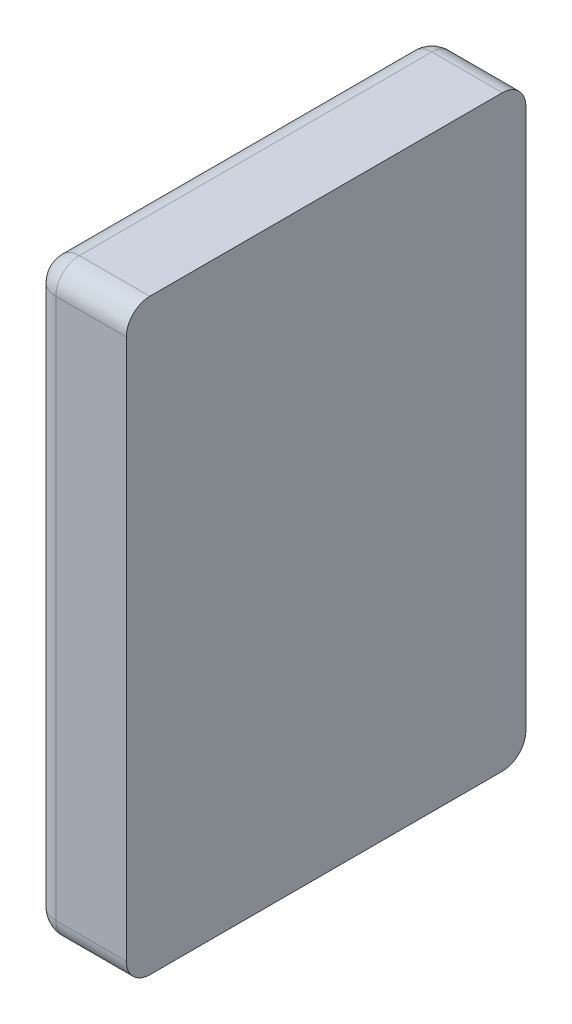
ISO-10303-21;
HEADER;
FILE_DESCRIPTION(('STEP AP214'),'2;1');
FILE_NAME('part.step','',(''),(''),'','','');
FILE_SCHEMA(('AUTOMOTIVE_DESIGN { 1 0 10303 214 1 1 1 1 }'));
ENDSEC;
DATA;
#1=APPLICATION_CONTEXT('core data for automotive mechanical design processes');
#2=APPLICATION_PROTOCOL_DEFINITION('international standard','automotive_design',2000,#1);
#3=PRODUCT_CONTEXT('',#1,'mechanical');
#4=PRODUCT('Part','Part','',(#3));
#5=PRODUCT_RELATED_PRODUCT_CATEGORY('part','',(#4));
#6=PRODUCT_DEFINITION_FORMATION('','',#4);
#7=PRODUCT_DEFINITION_CONTEXT('part definition',#1,'design');
#8=PRODUCT_DEFINITION('design','',#6,#7);
#9=PRODUCT_DEFINITION_SHAPE('','',#8);
#10=(LENGTH_UNIT() NAMED_UNIT(*) SI_UNIT(.MILLI.,.METRE.));
#11=(NAMED_UNIT(*) PLANE_ANGLE_UNIT() SI_UNIT($,.RADIAN.));
#12=(NAMED_UNIT(*) SI_UNIT($,.STERADIAN.) SOLID_ANGLE_UNIT());
#13=UNCERTAINTY_MEASURE_WITH_UNIT(LENGTH_MEASURE(1.E-05),#10,'distance_accuracy_value','');
#14=(GEOMETRIC_REPRESENTATION_CONTEXT(3) GLOBAL_UNCERTAINTY_ASSIGNED_CONTEXT((#13)) GLOBAL_UNIT_ASSIGNED_CONTEXT((#10,
#11,#12)) REPRESENTATION_CONTEXT('',''));
#15=CARTESIAN_POINT('',(0.,0.,0.));
#16=DIRECTION('',(0.,0.,1.));
#17=DIRECTION('',(1.,0.,0.));
#18=AXIS2_PLACEMENT_3D('',#15,#16,#17);
#19=CARTESIAN_POINT('',(-0.9,-0.625,0.));
#20=DIRECTION('',(0.,0.,1.));
#21=DIRECTION('',(1.,0.,0.));
#22=AXIS2_PLACEMENT_3D('',#19,#20,#21);
#23=PLANE('',#22);
#24=DIRECTION('',(0.,1.,0.));
#25=VECTOR('',#24,1.);
#26=CARTESIAN_POINT('',(-0.95,-0.625,0.));
#27=LINE('',#26,#25);
#28=CARTESIAN_POINT('',(-0.95,-0.575,0.));
#29=VERTEX_POINT('',#28);
#30=CARTESIAN_POINT('',(-0.95,0.575,0.));
#31=VERTEX_POINT('',#30);
#32=EDGE_CURVE('E233',#29,#31,#27,.T.);
#33=ORIENTED_EDGE('',*,*,#32,.T.);
#34=DIRECTION('',(1.,0.,0.));
#35=VECTOR('',#34,1.);
#36=CARTESIAN_POINT('',(-0.9,0.575,0.));
#37=LINE('',#36,#35);
#38=CARTESIAN_POINT('',(-0.8,0.575,0.));
#39=VERTEX_POINT('',#38);
#40=EDGE_CURVE('E69',#31,#39,#37,.T.);
#41=ORIENTED_EDGE('',*,*,#40,.T.);
#42=DIRECTION('',(0.,1.,0.));
#43=VECTOR('',#42,1.);
#44=CARTESIAN_POINT('',(-0.8,-0.625,0.));
#45=LINE('',#44,#43);
#46=CARTESIAN_POINT('',(-0.8,-0.575,0.));
#47=VERTEX_POINT('',#46);
#48=EDGE_CURVE('E172',#47,#39,#45,.T.);
#49=ORIENTED_EDGE('',*,*,#48,.F.);
#50=DIRECTION('',(-1.,0.,0.));
#51=VECTOR('',#50,1.);
#52=CARTESIAN_POINT('',(-1.,-0.575,0.));
#53=LINE('',#52,#51);
#54=EDGE_CURVE('E83',#47,#29,#53,.T.);
#55=ORIENTED_EDGE('',*,*,#54,.T.);
#56=EDGE_LOOP('',(#33,#41,#49,#55));
#57=FACE_BOUND('',#56,.T.);
#58=ADVANCED_FACE('F17',(#57),#23,.F.);
#59=CARTESIAN_POINT('',(-0.5,-0.625,0.425));
#60=DIRECTION('',(0.,-1.,0.));
#61=DIRECTION('',(0.,0.,-1.));
#62=AXIS2_PLACEMENT_3D('',#59,#60,#61);
#63=PLANE('',#62);
#64=DIRECTION('',(0.,0.,1.));
#65=VECTOR('',#64,1.);
#66=CARTESIAN_POINT('',(-0.8,-0.625,0.649600008));
#67=LINE('',#66,#65);
#68=CARTESIAN_POINT('',(-0.8,-0.625,0.05));
#69=VERTEX_POINT('',#68);
#70=CARTESIAN_POINT('',(-0.8,-0.625,0.8));
#71=VERTEX_POINT('',#70);
#72=EDGE_CURVE('E190',#69,#71,#67,.T.);
#73=ORIENTED_EDGE('',*,*,#72,.T.);
#74=DIRECTION('',(-1.,0.,0.));
#75=VECTOR('',#74,1.);
#76=CARTESIAN_POINT('',(-1.,-0.625,0.8));
#77=LINE('',#76,#75);
#78=CARTESIAN_POINT('',(-0.95,-0.625,0.8));
#79=VERTEX_POINT('',#78);
#80=EDGE_CURVE('E11',#71,#79,#77,.T.);
#81=ORIENTED_EDGE('',*,*,#80,.T.);
#82=DIRECTION('',(0.,0.,-1.));
#83=VECTOR('',#82,1.);
#84=CARTESIAN_POINT('',(-0.95,-0.625,0.));
#85=LINE('',#84,#83);
#86=CARTESIAN_POINT('',(-0.95,-0.625,0.05));
#87=VERTEX_POINT('',#86);
#88=EDGE_CURVE('E28',#79,#87,#85,.T.);
#89=ORIENTED_EDGE('',*,*,#88,.T.);
#90=DIRECTION('',(1.,0.,0.));
#91=VECTOR('',#90,1.);
#92=CARTESIAN_POINT('',(-0.8,-0.625,0.05));
#93=LINE('',#92,#91);
#94=EDGE_CURVE('E167',#87,#69,#93,.T.);
#95=ORIENTED_EDGE('',*,*,#94,.T.);
#96=EDGE_LOOP('',(#73,#81,#89,#95));
#97=FACE_BOUND('',#96,.T.);
#98=ADVANCED_FACE('F19',(#97),#63,.T.);
#99=CARTESIAN_POINT('',(-0.5,0.625,0.425));
#100=DIRECTION('',(0.,-1.,0.));
#101=DIRECTION('',(0.,0.,-1.));
#102=AXIS2_PLACEMENT_3D('',#99,#100,#101);
#103=PLANE('',#102);
#104=DIRECTION('',(0.,0.,1.));
#105=VECTOR('',#104,1.);
#106=CARTESIAN_POINT('',(-0.95,0.625,0.425));
#107=LINE('',#106,#105);
#108=CARTESIAN_POINT('',(-0.95,0.625,0.05));
#109=VERTEX_POINT('',#108);
#110=CARTESIAN_POINT('',(-0.95,0.625,0.8));
#111=VERTEX_POINT('',#110);
#112=EDGE_CURVE('E132',#109,#111,#107,.T.);
#113=ORIENTED_EDGE('',*,*,#112,.T.);
#114=DIRECTION('',(1.,0.,0.));
#115=VECTOR('',#114,1.);
#116=CARTESIAN_POINT('',(-0.5,0.625,0.8));
#117=LINE('',#116,#115);
#118=CARTESIAN_POINT('',(-0.8,0.625,0.8));
#119=VERTEX_POINT('',#118);
#120=EDGE_CURVE('E222',#111,#119,#117,.T.);
#121=ORIENTED_EDGE('',*,*,#120,.T.);
#122=DIRECTION('',(0.,0.,1.));
#123=VECTOR('',#122,1.);
#124=CARTESIAN_POINT('',(-0.8,0.625,0.649600008));
#125=LINE('',#124,#123);
#126=CARTESIAN_POINT('',(-0.8,0.625,0.05));
#127=VERTEX_POINT('',#126);
#128=EDGE_CURVE('E136',#127,#119,#125,.T.);
#129=ORIENTED_EDGE('',*,*,#128,.F.);
#130=DIRECTION('',(-1.,0.,0.));
#131=VECTOR('',#130,1.);
#132=CARTESIAN_POINT('',(-0.5,0.625,0.05));
#133=LINE('',#132,#131);
#134=EDGE_CURVE('E127',#127,#109,#133,.T.);
#135=ORIENTED_EDGE('',*,*,#134,.T.);
#136=EDGE_LOOP('',(#113,#121,#129,#135));
#137=FACE_BOUND('',#136,.T.);
#138=ADVANCED_FACE('F129',(#137),#103,.F.);
#139=CARTESIAN_POINT('',(-0.5,-0.575,0.8));
#140=DIRECTION('',(-1.,0.,0.));
#141=DIRECTION('',(0.,0.,-1.));
#142=AXIS2_PLACEMENT_3D('',#139,#140,#141);
#143=CYLINDRICAL_SURFACE('',#142,0.05);
#144=CARTESIAN_POINT('',(-0.8,-0.575,0.8));
#145=DIRECTION('',(1.,0.,0.));
#146=DIRECTION('',(0.,0.,1.));
#147=AXIS2_PLACEMENT_3D('',#144,#145,#146);
#148=CIRCLE('',#147,0.05);
#149=CARTESIAN_POINT('',(-0.8,-0.575,0.85));
#150=VERTEX_POINT('',#149);
#151=EDGE_CURVE('E196',#150,#71,#148,.T.);
#152=ORIENTED_EDGE('',*,*,#151,.F.);
#153=DIRECTION('',(1.,0.,0.));
#154=VECTOR('',#153,1.);
#155=CARTESIAN_POINT('',(-0.8,-0.575,0.85));
#156=LINE('',#155,#154);
#157=CARTESIAN_POINT('',(-0.95,-0.575,0.85));
#158=VERTEX_POINT('',#157);
#159=EDGE_CURVE('E236',#158,#150,#156,.T.);
#160=ORIENTED_EDGE('',*,*,#159,.F.);
#161=CARTESIAN_POINT('',(-0.95,-0.575,0.8));
#162=DIRECTION('',(-1.,0.,0.));
#163=DIRECTION('',(0.,0.,1.));
#164=AXIS2_PLACEMENT_3D('',#161,#162,#163);
#165=CIRCLE('',#164,0.05);
#166=EDGE_CURVE('E257',#79,#158,#165,.T.);
#167=ORIENTED_EDGE('',*,*,#166,.F.);
#168=ORIENTED_EDGE('',*,*,#80,.F.);
#169=EDGE_LOOP('',(#152,#160,#167,#168));
#170=FACE_BOUND('',#169,.T.);
#171=ADVANCED_FACE('F312',(#170),#143,.T.);
#172=CARTESIAN_POINT('',(-0.95,-0.575,0.425));
#173=DIRECTION('',(0.,0.,-1.));
#174=DIRECTION('',(1.,0.,0.));
#175=AXIS2_PLACEMENT_3D('',#172,#173,#174);
#176=CYLINDRICAL_SURFACE('',#175,0.05);
#177=CARTESIAN_POINT('',(-0.95,-0.575,0.05));
#178=DIRECTION('',(0.,0.,-1.));
#179=DIRECTION('',(-1.,0.,0.));
#180=AXIS2_PLACEMENT_3D('',#177,#178,#179);
#181=CIRCLE('',#180,0.05);
#182=CARTESIAN_POINT('',(-1.,-0.575,0.05));
#183=VERTEX_POINT('',#182);
#184=EDGE_CURVE('E227',#87,#183,#181,.T.);
#185=ORIENTED_EDGE('',*,*,#184,.F.);
#186=ORIENTED_EDGE('',*,*,#88,.F.);
#187=CARTESIAN_POINT('',(-0.95,-0.575,0.8));
#188=DIRECTION('',(0.,0.,1.));
#189=DIRECTION('',(1.,0.,0.));
#190=AXIS2_PLACEMENT_3D('',#187,#188,#189);
#191=CIRCLE('',#190,0.05);
#192=CARTESIAN_POINT('',(-1.,-0.575,0.8));
#193=VERTEX_POINT('',#192);
#194=EDGE_CURVE('E114',#193,#79,#191,.T.);
#195=ORIENTED_EDGE('',*,*,#194,.F.);
#196=DIRECTION('',(0.,0.,1.));
#197=VECTOR('',#196,1.);
#198=CARTESIAN_POINT('',(-1.,-0.575,0.85));
#199=LINE('',#198,#197);
#200=EDGE_CURVE('E195',#183,#193,#199,.T.);
#201=ORIENTED_EDGE('',*,*,#200,.F.);
#202=EDGE_LOOP('',(#185,#186,#195,#201));
#203=FACE_BOUND('',#202,.T.);
#204=ADVANCED_FACE('F308',(#203),#176,.T.);
#205=CARTESIAN_POINT('',(-0.5,-0.575,0.05));
#206=DIRECTION('',(1.,0.,0.));
#207=DIRECTION('',(0.,0.,1.));
#208=AXIS2_PLACEMENT_3D('',#205,#206,#207);
#209=CYLINDRICAL_SURFACE('',#208,0.05);
#210=CARTESIAN_POINT('',(-0.8,-0.575,0.05));
#211=DIRECTION('',(1.,0.,0.));
#212=DIRECTION('',(0.,0.,1.));
#213=AXIS2_PLACEMENT_3D('',#210,#211,#212);
#214=CIRCLE('',#213,0.05);
#215=EDGE_CURVE('E187',#69,#47,#214,.T.);
#216=ORIENTED_EDGE('',*,*,#215,.F.);
#217=ORIENTED_EDGE('',*,*,#94,.F.);
#218=CARTESIAN_POINT('',(-0.95,-0.575,0.05));
#219=DIRECTION('',(-1.,0.,0.));
#220=DIRECTION('',(0.,0.,1.));
#221=AXIS2_PLACEMENT_3D('',#218,#219,#220);
#222=CIRCLE('',#221,0.05);
#223=EDGE_CURVE('E225',#29,#87,#222,.T.);
#224=ORIENTED_EDGE('',*,*,#223,.F.);
#225=ORIENTED_EDGE('',*,*,#54,.F.);
#226=EDGE_LOOP('',(#216,#217,#224,#225));
#227=FACE_BOUND('',#226,.T.);
#228=ADVANCED_FACE('F311',(#227),#209,.T.);
#229=CARTESIAN_POINT('',(-0.95,-0.575,0.8));
#230=DIRECTION('',(0.,0.,1.));
#231=DIRECTION('',(1.,0.,0.));
#232=AXIS2_PLACEMENT_3D('',#229,#230,#231);
#233=SPHERICAL_SURFACE('',#232,0.05);
#234=ORIENTED_EDGE('',*,*,#194,.T.);
#235=ORIENTED_EDGE('',*,*,#166,.T.);
#236=CARTESIAN_POINT('',(-0.95,-0.575,0.8));
#237=DIRECTION('',(0.,1.,0.));
#238=DIRECTION('',(0.,0.,-1.));
#239=AXIS2_PLACEMENT_3D('',#236,#237,#238);
#240=CIRCLE('',#239,0.05);
#241=EDGE_CURVE('E226',#193,#158,#240,.T.);
#242=ORIENTED_EDGE('',*,*,#241,.F.);
#243=EDGE_LOOP('',(#234,#235,#242));
#244=FACE_BOUND('',#243,.T.);
#245=ADVANCED_FACE('F321',(#244),#233,.T.);
#246=CARTESIAN_POINT('',(-0.95,-0.575,0.05));
#247=DIRECTION('',(0.,0.,1.));
#248=DIRECTION('',(1.,0.,0.));
#249=AXIS2_PLACEMENT_3D('',#246,#247,#248);
#250=SPHERICAL_SURFACE('',#249,0.05);
#251=ORIENTED_EDGE('',*,*,#223,.T.);
#252=ORIENTED_EDGE('',*,*,#184,.T.);
#253=CARTESIAN_POINT('',(-0.95,-0.575,0.05));
#254=DIRECTION('',(0.,1.,0.));
#255=DIRECTION('',(0.,0.,-1.));
#256=AXIS2_PLACEMENT_3D('',#253,#254,#255);
#257=CIRCLE('',#256,0.05);
#258=EDGE_CURVE('E140',#29,#183,#257,.T.);
#259=ORIENTED_EDGE('',*,*,#258,.F.);
#260=EDGE_LOOP('',(#251,#252,#259));
#261=FACE_BOUND('',#260,.T.);
#262=ADVANCED_FACE('F328',(#261),#250,.T.);
#263=CARTESIAN_POINT('',(-0.9,0.575,0.8));
#264=DIRECTION('',(1.,0.,0.));
#265=DIRECTION('',(0.,0.,1.));
#266=AXIS2_PLACEMENT_3D('',#263,#264,#265);
#267=CYLINDRICAL_SURFACE('',#266,0.05);
#268=CARTESIAN_POINT('',(-0.8,0.575,0.8));
#269=DIRECTION('',(1.,0.,0.));
#270=DIRECTION('',(0.,0.,1.));
#271=AXIS2_PLACEMENT_3D('',#268,#269,#270);
#272=CIRCLE('',#271,0.05);
#273=CARTESIAN_POINT('',(-0.8,0.575,0.85));
#274=VERTEX_POINT('',#273);
#275=EDGE_CURVE('E194',#119,#274,#272,.T.);
#276=ORIENTED_EDGE('',*,*,#275,.F.);
#277=ORIENTED_EDGE('',*,*,#120,.F.);
#278=CARTESIAN_POINT('',(-0.95,0.575,0.8));
#279=DIRECTION('',(-1.,0.,0.));
#280=DIRECTION('',(0.,0.,1.));
#281=AXIS2_PLACEMENT_3D('',#278,#279,#280);
#282=CIRCLE('',#281,0.05);
#283=CARTESIAN_POINT('',(-0.95,0.575,0.85));
#284=VERTEX_POINT('',#283);
#285=EDGE_CURVE('E175',#284,#111,#282,.T.);
#286=ORIENTED_EDGE('',*,*,#285,.F.);
#287=DIRECTION('',(-1.,0.,0.));
#288=VECTOR('',#287,1.);
#289=CARTESIAN_POINT('',(-0.9,0.575,0.85));
#290=LINE('',#289,#288);
#291=EDGE_CURVE('E180',#274,#284,#290,.T.);
#292=ORIENTED_EDGE('',*,*,#291,.F.);
#293=EDGE_LOOP('',(#276,#277,#286,#292));
#294=FACE_BOUND('',#293,.T.);
#295=ADVANCED_FACE('F295',(#294),#267,.T.);
#296=CARTESIAN_POINT('',(-0.95,-0.625,0.8));
#297=DIRECTION('',(0.,-1.,0.));
#298=DIRECTION('',(0.,0.,1.));
#299=AXIS2_PLACEMENT_3D('',#296,#297,#298);
#300=CYLINDRICAL_SURFACE('',#299,0.05);
#301=ORIENTED_EDGE('',*,*,#241,.T.);
#302=DIRECTION('',(0.,-1.,0.));
#303=VECTOR('',#302,1.);
#304=CARTESIAN_POINT('',(-0.95,-0.625,0.85));
#305=LINE('',#304,#303);
#306=EDGE_CURVE('E184',#284,#158,#305,.T.);
#307=ORIENTED_EDGE('',*,*,#306,.F.);
#308=CARTESIAN_POINT('',(-0.95,0.575,0.8));
#309=DIRECTION('',(0.,1.,0.));
#310=DIRECTION('',(0.,0.,1.));
#311=AXIS2_PLACEMENT_3D('',#308,#309,#310);
#312=CIRCLE('',#311,0.05);
#313=CARTESIAN_POINT('',(-1.,0.575,0.8));
#314=VERTEX_POINT('',#313);
#315=EDGE_CURVE('E100',#314,#284,#312,.T.);
#316=ORIENTED_EDGE('',*,*,#315,.F.);
#317=DIRECTION('',(0.,1.,0.));
#318=VECTOR('',#317,1.);
#319=CARTESIAN_POINT('',(-1.,-0.625,0.8));
#320=LINE('',#319,#318);
#321=EDGE_CURVE('E216',#193,#314,#320,.T.);
#322=ORIENTED_EDGE('',*,*,#321,.F.);
#323=EDGE_LOOP('',(#301,#307,#316,#322));
#324=FACE_BOUND('',#323,.T.);
#325=ADVANCED_FACE('F291',(#324),#300,.T.);
#326=CARTESIAN_POINT('',(-0.95,-0.625,0.05));
#327=DIRECTION('',(0.,-1.,0.));
#328=DIRECTION('',(0.,0.,1.));
#329=AXIS2_PLACEMENT_3D('',#326,#327,#328);
#330=CYLINDRICAL_SURFACE('',#329,0.05);
#331=ORIENTED_EDGE('',*,*,#258,.T.);
#332=DIRECTION('',(0.,-1.,0.));
#333=VECTOR('',#332,1.);
#334=CARTESIAN_POINT('',(-1.,-0.625,0.05));
#335=LINE('',#334,#333);
#336=CARTESIAN_POINT('',(-1.,0.575,0.05));
#337=VERTEX_POINT('',#336);
#338=EDGE_CURVE('E218',#337,#183,#335,.T.);
#339=ORIENTED_EDGE('',*,*,#338,.F.);
#340=CARTESIAN_POINT('',(-0.95,0.575,0.05));
#341=DIRECTION('',(0.,1.,0.));
#342=DIRECTION('',(0.,0.,1.));
#343=AXIS2_PLACEMENT_3D('',#340,#341,#342);
#344=CIRCLE('',#343,0.05);
#345=EDGE_CURVE('E21',#31,#337,#344,.T.);
#346=ORIENTED_EDGE('',*,*,#345,.F.);
#347=ORIENTED_EDGE('',*,*,#32,.F.);
#348=EDGE_LOOP('',(#331,#339,#346,#347));
#349=FACE_BOUND('',#348,.T.);
#350=ADVANCED_FACE('F288',(#349),#330,.T.);
#351=CARTESIAN_POINT('',(-0.9,0.575,0.05));
#352=DIRECTION('',(-1.,0.,0.));
#353=DIRECTION('',(0.,0.,-1.));
#354=AXIS2_PLACEMENT_3D('',#351,#352,#353);
#355=CYLINDRICAL_SURFACE('',#354,0.05);
#356=CARTESIAN_POINT('',(-0.8,0.575,0.05));
#357=DIRECTION('',(1.,0.,0.));
#358=DIRECTION('',(0.,0.,1.));
#359=AXIS2_PLACEMENT_3D('',#356,#357,#358);
#360=CIRCLE('',#359,0.05);
#361=EDGE_CURVE('E164',#39,#127,#360,.T.);
#362=ORIENTED_EDGE('',*,*,#361,.F.);
#363=ORIENTED_EDGE('',*,*,#40,.F.);
#364=CARTESIAN_POINT('',(-0.95,0.575,0.05));
#365=DIRECTION('',(-1.,0.,0.));
#366=DIRECTION('',(0.,0.,1.));
#367=AXIS2_PLACEMENT_3D('',#364,#365,#366);
#368=CIRCLE('',#367,0.05);
#369=EDGE_CURVE('E142',#109,#31,#368,.T.);
#370=ORIENTED_EDGE('',*,*,#369,.F.);
#371=ORIENTED_EDGE('',*,*,#134,.F.);
#372=EDGE_LOOP('',(#362,#363,#370,#371));
#373=FACE_BOUND('',#372,.T.);
#374=ADVANCED_FACE('F144',(#373),#355,.T.);
#375=CARTESIAN_POINT('',(-0.95,0.575,0.8));
#376=DIRECTION('',(0.,0.,1.));
#377=DIRECTION('',(1.,0.,0.));
#378=AXIS2_PLACEMENT_3D('',#375,#376,#377);
#379=SPHERICAL_SURFACE('',#378,0.05);
#380=ORIENTED_EDGE('',*,*,#315,.T.);
#381=ORIENTED_EDGE('',*,*,#285,.T.);
#382=CARTESIAN_POINT('',(-0.95,0.575,0.8));
#383=DIRECTION('',(0.,0.,-1.));
#384=DIRECTION('',(1.,0.,0.));
#385=AXIS2_PLACEMENT_3D('',#382,#383,#384);
#386=CIRCLE('',#385,0.05);
#387=EDGE_CURVE('E158',#314,#111,#386,.T.);
#388=ORIENTED_EDGE('',*,*,#387,.F.);
#389=EDGE_LOOP('',(#380,#381,#388));
#390=FACE_BOUND('',#389,.T.);
#391=ADVANCED_FACE('F299',(#390),#379,.T.);
#392=CARTESIAN_POINT('',(-0.95,0.575,0.05));
#393=DIRECTION('',(0.,0.,1.));
#394=DIRECTION('',(1.,0.,0.));
#395=AXIS2_PLACEMENT_3D('',#392,#393,#394);
#396=SPHERICAL_SURFACE('',#395,0.05);
#397=ORIENTED_EDGE('',*,*,#369,.T.);
#398=ORIENTED_EDGE('',*,*,#345,.T.);
#399=CARTESIAN_POINT('',(-0.95,0.575,0.05));
#400=DIRECTION('',(0.,0.,1.));
#401=DIRECTION('',(-1.,0.,0.));
#402=AXIS2_PLACEMENT_3D('',#399,#400,#401);
#403=CIRCLE('',#402,0.05);
#404=EDGE_CURVE('E148',#109,#337,#403,.T.);
#405=ORIENTED_EDGE('',*,*,#404,.F.);
#406=EDGE_LOOP('',(#397,#398,#405));
#407=FACE_BOUND('',#406,.T.);
#408=ADVANCED_FACE('F151',(#407),#396,.T.);
#409=CARTESIAN_POINT('',(-0.95,0.575,0.425));
#410=DIRECTION('',(0.,0.,1.));
#411=DIRECTION('',(-1.,0.,0.));
#412=AXIS2_PLACEMENT_3D('',#409,#410,#411);
#413=CYLINDRICAL_SURFACE('',#412,0.05);
#414=ORIENTED_EDGE('',*,*,#387,.T.);
#415=ORIENTED_EDGE('',*,*,#112,.F.);
#416=ORIENTED_EDGE('',*,*,#404,.T.);
#417=DIRECTION('',(0.,0.,-1.));
#418=VECTOR('',#417,1.);
#419=CARTESIAN_POINT('',(-1.,0.575,0.425));
#420=LINE('',#419,#418);
#421=EDGE_CURVE('E221',#314,#337,#420,.T.);
#422=ORIENTED_EDGE('',*,*,#421,.F.);
#423=EDGE_LOOP('',(#414,#415,#416,#422));
#424=FACE_BOUND('',#423,.T.);
#425=ADVANCED_FACE('F157',(#424),#413,.T.);
#426=CARTESIAN_POINT('',(-0.8,-0.625,0.649600008));
#427=DIRECTION('',(-1.,0.,0.));
#428=DIRECTION('',(0.,0.,1.));
#429=AXIS2_PLACEMENT_3D('',#426,#427,#428);
#430=PLANE('',#429);
#431=ORIENTED_EDGE('',*,*,#128,.T.);
#432=ORIENTED_EDGE('',*,*,#275,.T.);
#433=DIRECTION('',(0.,1.,0.));
#434=VECTOR('',#433,1.);
#435=CARTESIAN_POINT('',(-0.8,-0.625,0.85));
#436=LINE('',#435,#434);
#437=EDGE_CURVE('E176',#150,#274,#436,.T.);
#438=ORIENTED_EDGE('',*,*,#437,.F.);
#439=ORIENTED_EDGE('',*,*,#151,.T.);
#440=ORIENTED_EDGE('',*,*,#72,.F.);
#441=ORIENTED_EDGE('',*,*,#215,.T.);
#442=ORIENTED_EDGE('',*,*,#48,.T.);
#443=ORIENTED_EDGE('',*,*,#361,.T.);
#444=EDGE_LOOP('',(#431,#432,#438,#439,#440,#441,#442,#443));
#445=FACE_BOUND('',#444,.T.);
#446=ADVANCED_FACE('F279',(#445),#430,.F.);
#447=CARTESIAN_POINT('',(-1.,-0.625,0.425));
#448=DIRECTION('',(1.,0.,0.));
#449=DIRECTION('',(0.,1.,0.));
#450=AXIS2_PLACEMENT_3D('',#447,#448,#449);
#451=PLANE('',#450);
#452=ORIENTED_EDGE('',*,*,#321,.T.);
#453=ORIENTED_EDGE('',*,*,#421,.T.);
#454=ORIENTED_EDGE('',*,*,#338,.T.);
#455=ORIENTED_EDGE('',*,*,#200,.T.);
#456=EDGE_LOOP('',(#452,#453,#454,#455));
#457=FACE_BOUND('',#456,.T.);
#458=ADVANCED_FACE('F298',(#457),#451,.F.);
#459=CARTESIAN_POINT('',(-0.9,-0.625,0.85));
#460=DIRECTION('',(0.,0.,-1.));
#461=DIRECTION('',(0.,-1.,0.));
#462=AXIS2_PLACEMENT_3D('',#459,#460,#461);
#463=PLANE('',#462);
#464=ORIENTED_EDGE('',*,*,#437,.T.);
#465=ORIENTED_EDGE('',*,*,#291,.T.);
#466=ORIENTED_EDGE('',*,*,#306,.T.);
#467=ORIENTED_EDGE('',*,*,#159,.T.);
#468=EDGE_LOOP('',(#464,#465,#466,#467));
#469=FACE_BOUND('',#468,.T.);
#470=ADVANCED_FACE('F303',(#469),#463,.F.);
#471=CLOSED_SHELL('',(#58,#98,#138,#171,#204,#228,#245,#262,#295,#325,#350,#374,#391,#408,#425,
#446,#458,#470));
#472=MANIFOLD_SOLID_BREP('B1',#471);
#473=ADVANCED_BREP_SHAPE_REPRESENTATION('',(#18,#472),#14);
#474=SHAPE_DEFINITION_REPRESENTATION(#9,#473);
ENDSEC;
END-ISO-10303-21;
